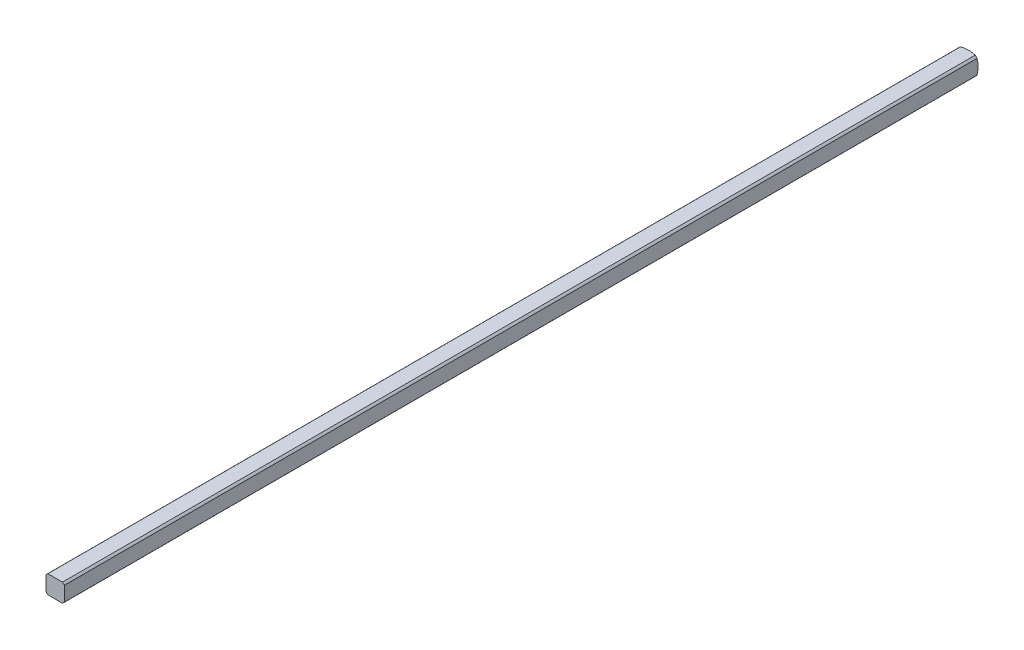
ISO-10303-21;
HEADER;
FILE_DESCRIPTION(('STEP AP214'),'2;1');
FILE_NAME('part.step','',(''),(''),'','','');
FILE_SCHEMA(('AUTOMOTIVE_DESIGN { 1 0 10303 214 1 1 1 1 }'));
ENDSEC;
DATA;
#1=APPLICATION_CONTEXT('core data for automotive mechanical design processes');
#2=APPLICATION_PROTOCOL_DEFINITION('international standard','automotive_design',2000,#1);
#3=PRODUCT_CONTEXT('',#1,'mechanical');
#4=PRODUCT('Part','Part','',(#3));
#5=PRODUCT_RELATED_PRODUCT_CATEGORY('part','',(#4));
#6=PRODUCT_DEFINITION_FORMATION('','',#4);
#7=PRODUCT_DEFINITION_CONTEXT('part definition',#1,'design');
#8=PRODUCT_DEFINITION('design','',#6,#7);
#9=PRODUCT_DEFINITION_SHAPE('','',#8);
#10=(LENGTH_UNIT() NAMED_UNIT(*) SI_UNIT(.MILLI.,.METRE.));
#11=(NAMED_UNIT(*) PLANE_ANGLE_UNIT() SI_UNIT($,.RADIAN.));
#12=(NAMED_UNIT(*) SI_UNIT($,.STERADIAN.) SOLID_ANGLE_UNIT());
#13=UNCERTAINTY_MEASURE_WITH_UNIT(LENGTH_MEASURE(1.E-05),#10,'distance_accuracy_value','');
#14=(GEOMETRIC_REPRESENTATION_CONTEXT(3) GLOBAL_UNCERTAINTY_ASSIGNED_CONTEXT((#13)) GLOBAL_UNIT_ASSIGNED_CONTEXT((#10,
#11,#12)) REPRESENTATION_CONTEXT('',''));
#15=CARTESIAN_POINT('',(0.,0.,0.));
#16=DIRECTION('',(0.,0.,1.));
#17=DIRECTION('',(1.,0.,0.));
#18=AXIS2_PLACEMENT_3D('',#15,#16,#17);
#19=CARTESIAN_POINT('',(-1.5875,-1.5875,152.4));
#20=DIRECTION('',(1.,0.,0.));
#21=DIRECTION('',(0.,0.,-1.));
#22=AXIS2_PLACEMENT_3D('',#19,#20,#21);
#23=PLANE('',#22);
#24=DIRECTION('',(0.,0.,-1.));
#25=VECTOR('',#24,1.);
#26=CARTESIAN_POINT('',(-1.5875,-1.26841150657032,152.4));
#27=LINE('',#26,#25);
#28=CARTESIAN_POINT('',(-1.5875,-1.26841150657032,158.486774642313));
#29=VERTEX_POINT('',#28);
#30=CARTESIAN_POINT('',(-1.5875,-1.26841150657032,0.263225357686905));
#31=VERTEX_POINT('',#30);
#32=EDGE_CURVE('E107',#29,#31,#27,.T.);
#33=ORIENTED_EDGE('',*,*,#32,.F.);
#34=DIRECTION('',(0.,1.,0.));
#35=VECTOR('',#34,1.);
#36=CARTESIAN_POINT('',(-1.5875,-1.5875,158.486774642313));
#37=LINE('',#36,#35);
#38=CARTESIAN_POINT('',(-1.5875,1.26841150657032,158.486774642313));
#39=VERTEX_POINT('',#38);
#40=EDGE_CURVE('E38',#29,#39,#37,.T.);
#41=ORIENTED_EDGE('',*,*,#40,.T.);
#42=DIRECTION('',(0.,0.,-1.));
#43=VECTOR('',#42,1.);
#44=CARTESIAN_POINT('',(-1.5875,1.26841150657032,152.4));
#45=LINE('',#44,#43);
#46=CARTESIAN_POINT('',(-1.5875,1.26841150657032,0.263225357687025));
#47=VERTEX_POINT('',#46);
#48=EDGE_CURVE('E116',#47,#39,#45,.F.);
#49=ORIENTED_EDGE('',*,*,#48,.F.);
#50=CARTESIAN_POINT('',(-1.5875,0.,4.91912226376204));
#51=DIRECTION('',(1.,0.,0.));
#52=DIRECTION('',(0.,0.,-1.));
#53=AXIS2_PLACEMENT_3D('',#50,#51,#52);
#54=CIRCLE('',#53,4.82558221875869);
#55=EDGE_CURVE('E141',#31,#47,#54,.T.);
#56=ORIENTED_EDGE('',*,*,#55,.F.);
#57=EDGE_LOOP('',(#33,#41,#49,#56));
#58=FACE_BOUND('',#57,.T.);
#59=ADVANCED_FACE('F34',(#58),#23,.F.);
#60=CARTESIAN_POINT('',(-1.5875,-1.5875,152.4));
#61=DIRECTION('',(0.,1.,0.));
#62=DIRECTION('',(0.,0.,1.));
#63=AXIS2_PLACEMENT_3D('',#60,#61,#62);
#64=PLANE('',#63);
#65=DIRECTION('',(0.,0.,-1.));
#66=VECTOR('',#65,1.);
#67=CARTESIAN_POINT('',(1.26841150657032,-1.5875,152.4));
#68=LINE('',#67,#66);
#69=CARTESIAN_POINT('',(1.26841150657032,-1.5875,158.486774642313));
#70=VERTEX_POINT('',#69);
#71=CARTESIAN_POINT('',(1.26841150657032,-1.5875,0.263225357686905));
#72=VERTEX_POINT('',#71);
#73=EDGE_CURVE('E138',#70,#72,#68,.T.);
#74=ORIENTED_EDGE('',*,*,#73,.F.);
#75=DIRECTION('',(1.,0.,0.));
#76=VECTOR('',#75,1.);
#77=CARTESIAN_POINT('',(-1.5875,-1.5875,158.486774642313));
#78=LINE('',#77,#76);
#79=CARTESIAN_POINT('',(-1.26841150657032,-1.5875,158.486774642313));
#80=VERTEX_POINT('',#79);
#81=EDGE_CURVE('E72',#80,#70,#78,.T.);
#82=ORIENTED_EDGE('',*,*,#81,.F.);
#83=DIRECTION('',(0.,0.,-1.));
#84=VECTOR('',#83,1.);
#85=CARTESIAN_POINT('',(-1.26841150657032,-1.5875,152.4));
#86=LINE('',#85,#84);
#87=CARTESIAN_POINT('',(-1.26841150657032,-1.5875,0.263225357686961));
#88=VERTEX_POINT('',#87);
#89=EDGE_CURVE('E146',#88,#80,#86,.F.);
#90=ORIENTED_EDGE('',*,*,#89,.F.);
#91=CARTESIAN_POINT('',(0.,-1.5875,4.91912226376204));
#92=DIRECTION('',(0.,1.,0.));
#93=DIRECTION('',(0.,0.,1.));
#94=AXIS2_PLACEMENT_3D('',#91,#92,#93);
#95=CIRCLE('',#94,4.82558221875869);
#96=EDGE_CURVE('E139',#72,#88,#95,.T.);
#97=ORIENTED_EDGE('',*,*,#96,.F.);
#98=EDGE_LOOP('',(#74,#82,#90,#97));
#99=FACE_BOUND('',#98,.T.);
#100=ADVANCED_FACE('F36',(#99),#64,.F.);
#101=CARTESIAN_POINT('',(1.5875,-1.5875,152.4));
#102=DIRECTION('',(-1.,0.,0.));
#103=DIRECTION('',(0.,0.,1.));
#104=AXIS2_PLACEMENT_3D('',#101,#102,#103);
#105=PLANE('',#104);
#106=DIRECTION('',(0.,0.,-1.));
#107=VECTOR('',#106,1.);
#108=CARTESIAN_POINT('',(1.5875,1.26841150657032,152.4));
#109=LINE('',#108,#107);
#110=CARTESIAN_POINT('',(1.5875,1.26841150657032,158.486774642313));
#111=VERTEX_POINT('',#110);
#112=CARTESIAN_POINT('',(1.5875,1.26841150657032,0.263225357686961));
#113=VERTEX_POINT('',#112);
#114=EDGE_CURVE('E149',#111,#113,#109,.T.);
#115=ORIENTED_EDGE('',*,*,#114,.F.);
#116=DIRECTION('',(0.,1.,0.));
#117=VECTOR('',#116,1.);
#118=CARTESIAN_POINT('',(1.5875,-1.5875,158.486774642313));
#119=LINE('',#118,#117);
#120=CARTESIAN_POINT('',(1.5875,-1.26841150657032,158.486774642313));
#121=VERTEX_POINT('',#120);
#122=EDGE_CURVE('E62',#121,#111,#119,.T.);
#123=ORIENTED_EDGE('',*,*,#122,.F.);
#124=DIRECTION('',(0.,0.,-1.));
#125=VECTOR('',#124,1.);
#126=CARTESIAN_POINT('',(1.5875,-1.26841150657032,152.4));
#127=LINE('',#126,#125);
#128=CARTESIAN_POINT('',(1.5875,-1.26841150657032,0.263225357686905));
#129=VERTEX_POINT('',#128);
#130=EDGE_CURVE('E127',#129,#121,#127,.F.);
#131=ORIENTED_EDGE('',*,*,#130,.F.);
#132=CARTESIAN_POINT('',(1.5875,0.,4.91912226376204));
#133=DIRECTION('',(-1.,0.,0.));
#134=DIRECTION('',(0.,0.,1.));
#135=AXIS2_PLACEMENT_3D('',#132,#133,#134);
#136=CIRCLE('',#135,4.82558221875869);
#137=EDGE_CURVE('E134',#113,#129,#136,.T.);
#138=ORIENTED_EDGE('',*,*,#137,.F.);
#139=EDGE_LOOP('',(#115,#123,#131,#138));
#140=FACE_BOUND('',#139,.T.);
#141=ADVANCED_FACE('F177',(#140),#105,.F.);
#142=CARTESIAN_POINT('',(-1.5875,1.5875,152.4));
#143=DIRECTION('',(0.,-1.,0.));
#144=DIRECTION('',(0.,0.,-1.));
#145=AXIS2_PLACEMENT_3D('',#142,#143,#144);
#146=PLANE('',#145);
#147=DIRECTION('',(0.,0.,-1.));
#148=VECTOR('',#147,1.);
#149=CARTESIAN_POINT('',(-1.26841150657032,1.5875,152.4));
#150=LINE('',#149,#148);
#151=CARTESIAN_POINT('',(-1.26841150657032,1.5875,158.486774642313));
#152=VERTEX_POINT('',#151);
#153=CARTESIAN_POINT('',(-1.26841150657032,1.5875,0.263225357686961));
#154=VERTEX_POINT('',#153);
#155=EDGE_CURVE('E113',#152,#154,#150,.T.);
#156=ORIENTED_EDGE('',*,*,#155,.F.);
#157=DIRECTION('',(1.,0.,0.));
#158=VECTOR('',#157,1.);
#159=CARTESIAN_POINT('',(-1.5875,1.5875,158.486774642313));
#160=LINE('',#159,#158);
#161=CARTESIAN_POINT('',(1.26841150657032,1.5875,158.486774642313));
#162=VERTEX_POINT('',#161);
#163=EDGE_CURVE('E100',#152,#162,#160,.T.);
#164=ORIENTED_EDGE('',*,*,#163,.T.);
#165=DIRECTION('',(0.,0.,-1.));
#166=VECTOR('',#165,1.);
#167=CARTESIAN_POINT('',(1.26841150657032,1.5875,152.4));
#168=LINE('',#167,#166);
#169=CARTESIAN_POINT('',(1.26841150657032,1.5875,0.263225357686905));
#170=VERTEX_POINT('',#169);
#171=EDGE_CURVE('E121',#170,#162,#168,.F.);
#172=ORIENTED_EDGE('',*,*,#171,.F.);
#173=CARTESIAN_POINT('',(0.,1.5875,4.91912226376204));
#174=DIRECTION('',(0.,-1.,0.));
#175=DIRECTION('',(0.,0.,-1.));
#176=AXIS2_PLACEMENT_3D('',#173,#174,#175);
#177=CIRCLE('',#176,4.82558221875869);
#178=EDGE_CURVE('E119',#154,#170,#177,.T.);
#179=ORIENTED_EDGE('',*,*,#178,.F.);
#180=EDGE_LOOP('',(#156,#164,#172,#179));
#181=FACE_BOUND('',#180,.T.);
#182=ADVANCED_FACE('F118',(#181),#146,.F.);
#183=CARTESIAN_POINT('',(0.,0.,152.4));
#184=DIRECTION('',(0.,0.,-1.));
#185=DIRECTION('',(-1.,0.,0.));
#186=AXIS2_PLACEMENT_3D('',#183,#184,#185);
#187=CYLINDRICAL_SURFACE('',#186,2.032);
#188=CARTESIAN_POINT('',(0.,0.,158.486774642313));
#189=DIRECTION('',(0.,0.,-1.));
#190=DIRECTION('',(-1.,0.,0.));
#191=AXIS2_PLACEMENT_3D('',#188,#189,#190);
#192=CIRCLE('',#191,2.032);
#193=EDGE_CURVE('E133',#29,#80,#192,.F.);
#194=ORIENTED_EDGE('',*,*,#193,.F.);
#195=ORIENTED_EDGE('',*,*,#32,.T.);
#196=CARTESIAN_POINT('',(0.,0.,0.263225357686961));
#197=DIRECTION('',(0.,0.,1.));
#198=DIRECTION('',(1.,0.,0.));
#199=AXIS2_PLACEMENT_3D('',#196,#197,#198);
#200=CIRCLE('',#199,2.032);
#201=EDGE_CURVE('E143',#31,#88,#200,.T.);
#202=ORIENTED_EDGE('',*,*,#201,.T.);
#203=ORIENTED_EDGE('',*,*,#89,.T.);
#204=EDGE_LOOP('',(#194,#195,#202,#203));
#205=FACE_BOUND('',#204,.T.);
#206=ADVANCED_FACE('F162',(#205),#187,.T.);
#207=CARTESIAN_POINT('',(0.,0.,158.486774642313));
#208=DIRECTION('',(0.,0.,-1.));
#209=DIRECTION('',(-1.,0.,0.));
#210=AXIS2_PLACEMENT_3D('',#207,#208,#209);
#211=CIRCLE('',#210,2.032);
#212=EDGE_CURVE('E68',#70,#121,#211,.F.);
#213=ORIENTED_EDGE('',*,*,#212,.F.);
#214=ORIENTED_EDGE('',*,*,#73,.T.);
#215=CARTESIAN_POINT('',(0.,0.,0.263225357686961));
#216=DIRECTION('',(0.,0.,1.));
#217=DIRECTION('',(1.,0.,0.));
#218=AXIS2_PLACEMENT_3D('',#215,#216,#217);
#219=CIRCLE('',#218,2.032);
#220=EDGE_CURVE('E135',#72,#129,#219,.T.);
#221=ORIENTED_EDGE('',*,*,#220,.T.);
#222=ORIENTED_EDGE('',*,*,#130,.T.);
#223=EDGE_LOOP('',(#213,#214,#221,#222));
#224=FACE_BOUND('',#223,.T.);
#225=ADVANCED_FACE('F173',(#224),#187,.T.);
#226=CARTESIAN_POINT('',(0.,0.,158.486774642313));
#227=DIRECTION('',(0.,0.,-1.));
#228=DIRECTION('',(-1.,0.,0.));
#229=AXIS2_PLACEMENT_3D('',#226,#227,#228);
#230=CIRCLE('',#229,2.032);
#231=EDGE_CURVE('E44',#111,#162,#230,.F.);
#232=ORIENTED_EDGE('',*,*,#231,.F.);
#233=ORIENTED_EDGE('',*,*,#114,.T.);
#234=CARTESIAN_POINT('',(0.,0.,0.263225357686961));
#235=DIRECTION('',(0.,0.,1.));
#236=DIRECTION('',(1.,0.,0.));
#237=AXIS2_PLACEMENT_3D('',#234,#235,#236);
#238=CIRCLE('',#237,2.032);
#239=EDGE_CURVE('E124',#113,#170,#238,.T.);
#240=ORIENTED_EDGE('',*,*,#239,.T.);
#241=ORIENTED_EDGE('',*,*,#171,.T.);
#242=EDGE_LOOP('',(#232,#233,#240,#241));
#243=FACE_BOUND('',#242,.T.);
#244=ADVANCED_FACE('F180',(#243),#187,.T.);
#245=CARTESIAN_POINT('',(0.,0.,158.486774642313));
#246=DIRECTION('',(0.,0.,-1.));
#247=DIRECTION('',(-1.,0.,0.));
#248=AXIS2_PLACEMENT_3D('',#245,#246,#247);
#249=CIRCLE('',#248,2.032);
#250=EDGE_CURVE('E12',#152,#39,#249,.F.);
#251=ORIENTED_EDGE('',*,*,#250,.F.);
#252=ORIENTED_EDGE('',*,*,#155,.T.);
#253=CARTESIAN_POINT('',(0.,0.,0.263225357686961));
#254=DIRECTION('',(0.,0.,1.));
#255=DIRECTION('',(1.,0.,0.));
#256=AXIS2_PLACEMENT_3D('',#253,#254,#255);
#257=CIRCLE('',#256,2.032);
#258=EDGE_CURVE('E120',#154,#47,#257,.T.);
#259=ORIENTED_EDGE('',*,*,#258,.T.);
#260=ORIENTED_EDGE('',*,*,#48,.T.);
#261=EDGE_LOOP('',(#251,#252,#259,#260));
#262=FACE_BOUND('',#261,.T.);
#263=ADVANCED_FACE('F111',(#262),#187,.T.);
#264=CARTESIAN_POINT('',(0.,0.,4.91912226376204));
#265=DIRECTION('',(0.,0.,1.));
#266=DIRECTION('',(-1.,0.,0.));
#267=AXIS2_PLACEMENT_3D('',#264,#265,#266);
#268=SPHERICAL_SURFACE('',#267,5.08);
#269=CARTESIAN_POINT('',(0.,0.,0.));
#270=DIRECTION('',(0.,0.,-1.));
#271=DIRECTION('',(-1.,0.,0.));
#272=AXIS2_PLACEMENT_3D('',#269,#270,#271);
#273=CIRCLE('',#272,1.26832020963187);
#274=CARTESIAN_POINT('',(-1.26832020963187,0.,0.));
#275=VERTEX_POINT('',#274);
#276=EDGE_CURVE('E130',#275,#275,#273,.T.);
#277=ORIENTED_EDGE('',*,*,#276,.F.);
#278=EDGE_LOOP('',(#277));
#279=FACE_BOUND('',#278,.T.);
#280=ORIENTED_EDGE('',*,*,#96,.T.);
#281=ORIENTED_EDGE('',*,*,#201,.F.);
#282=ORIENTED_EDGE('',*,*,#55,.T.);
#283=ORIENTED_EDGE('',*,*,#258,.F.);
#284=ORIENTED_EDGE('',*,*,#178,.T.);
#285=ORIENTED_EDGE('',*,*,#239,.F.);
#286=ORIENTED_EDGE('',*,*,#137,.T.);
#287=ORIENTED_EDGE('',*,*,#220,.F.);
#288=EDGE_LOOP('',(#280,#281,#282,#283,#284,#285,#286,#287));
#289=FACE_BOUND('',#288,.T.);
#290=ADVANCED_FACE('F179',(#279,#289),#268,.T.);
#291=CARTESIAN_POINT('',(0.,0.,0.));
#292=DIRECTION('',(0.,0.,-1.));
#293=DIRECTION('',(-1.,0.,0.));
#294=AXIS2_PLACEMENT_3D('',#291,#292,#293);
#295=PLANE('',#294);
#296=ORIENTED_EDGE('',*,*,#276,.T.);
#297=EDGE_LOOP('',(#296));
#298=FACE_BOUND('',#297,.T.);
#299=ADVANCED_FACE('F199',(#298),#295,.T.);
#300=CARTESIAN_POINT('',(-1.5875,-1.5875,158.486774642313));
#301=DIRECTION('',(0.,0.,-1.));
#302=DIRECTION('',(-1.,0.,0.));
#303=AXIS2_PLACEMENT_3D('',#300,#301,#302);
#304=PLANE('',#303);
#305=ORIENTED_EDGE('',*,*,#193,.T.);
#306=ORIENTED_EDGE('',*,*,#81,.T.);
#307=ORIENTED_EDGE('',*,*,#212,.T.);
#308=ORIENTED_EDGE('',*,*,#122,.T.);
#309=ORIENTED_EDGE('',*,*,#231,.T.);
#310=ORIENTED_EDGE('',*,*,#163,.F.);
#311=ORIENTED_EDGE('',*,*,#250,.T.);
#312=ORIENTED_EDGE('',*,*,#40,.F.);
#313=EDGE_LOOP('',(#305,#306,#307,#308,#309,#310,#311,#312));
#314=FACE_BOUND('',#313,.T.);
#315=ADVANCED_FACE('F102',(#314),#304,.F.);
#316=CLOSED_SHELL('',(#59,#100,#141,#182,#206,#225,#244,#263,#290,#299,#315));
#317=MANIFOLD_SOLID_BREP('B2',#316);
#318=ADVANCED_BREP_SHAPE_REPRESENTATION('',(#18,#317),#14);
#319=SHAPE_DEFINITION_REPRESENTATION(#9,#318);
ENDSEC;
END-ISO-10303-21;
